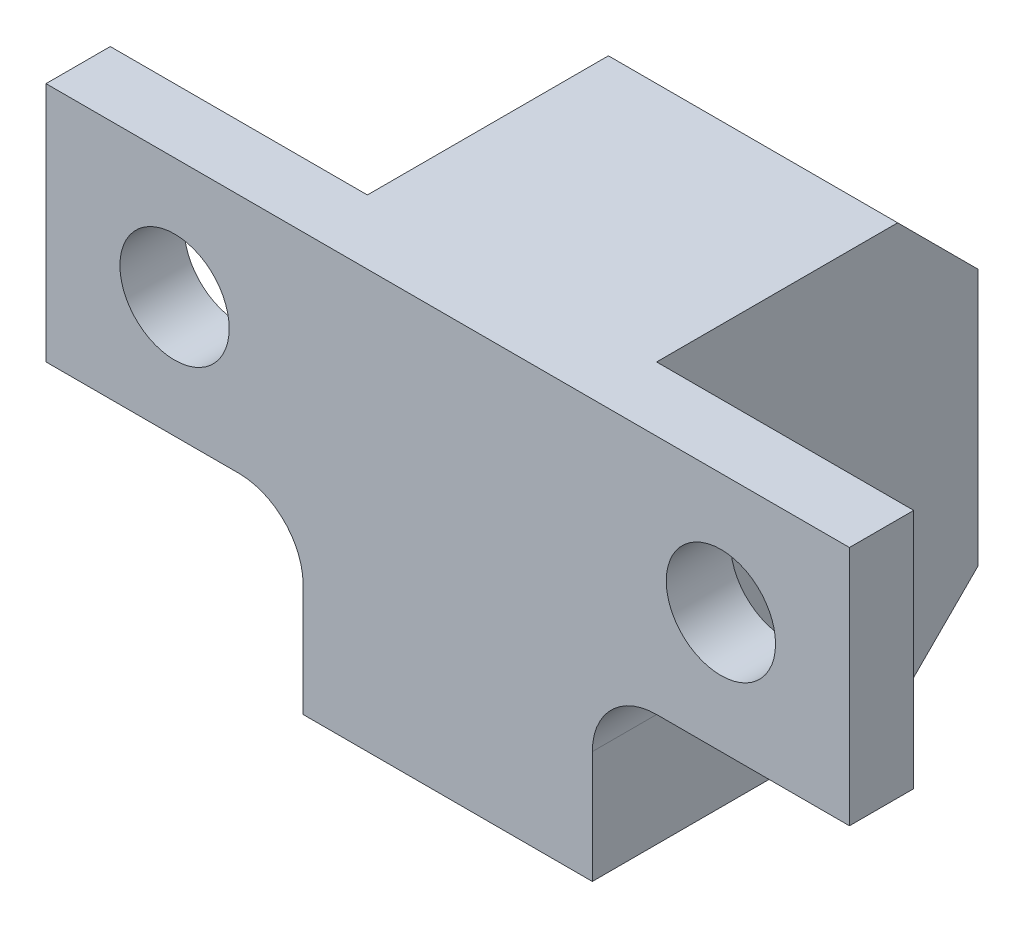
ISO-10303-21;
HEADER;
FILE_DESCRIPTION(('STEP AP214'),'2;1');
FILE_NAME('part.step','',(''),(''),'','','');
FILE_SCHEMA(('AUTOMOTIVE_DESIGN { 1 0 10303 214 1 1 1 1 }'));
ENDSEC;
DATA;
#1=APPLICATION_CONTEXT('core data for automotive mechanical design processes');
#2=APPLICATION_PROTOCOL_DEFINITION('international standard','automotive_design',2000,#1);
#3=PRODUCT_CONTEXT('',#1,'mechanical');
#4=PRODUCT('Part','Part','',(#3));
#5=PRODUCT_RELATED_PRODUCT_CATEGORY('part','',(#4));
#6=PRODUCT_DEFINITION_FORMATION('','',#4);
#7=PRODUCT_DEFINITION_CONTEXT('part definition',#1,'design');
#8=PRODUCT_DEFINITION('design','',#6,#7);
#9=PRODUCT_DEFINITION_SHAPE('','',#8);
#10=(LENGTH_UNIT() NAMED_UNIT(*) SI_UNIT(.MILLI.,.METRE.));
#11=(NAMED_UNIT(*) PLANE_ANGLE_UNIT() SI_UNIT($,.RADIAN.));
#12=(NAMED_UNIT(*) SI_UNIT($,.STERADIAN.) SOLID_ANGLE_UNIT());
#13=UNCERTAINTY_MEASURE_WITH_UNIT(LENGTH_MEASURE(1.E-05),#10,'distance_accuracy_value','');
#14=(GEOMETRIC_REPRESENTATION_CONTEXT(3) GLOBAL_UNCERTAINTY_ASSIGNED_CONTEXT((#13)) GLOBAL_UNIT_ASSIGNED_CONTEXT((#10,
#11,#12)) REPRESENTATION_CONTEXT('',''));
#15=CARTESIAN_POINT('',(0.,0.,0.));
#16=DIRECTION('',(0.,0.,1.));
#17=DIRECTION('',(1.,0.,0.));
#18=AXIS2_PLACEMENT_3D('',#15,#16,#17);
#19=CARTESIAN_POINT('',(0.,15.,0.));
#20=DIRECTION('',(0.,0.,-1.));
#21=DIRECTION('',(-1.,0.,0.));
#22=AXIS2_PLACEMENT_3D('',#19,#20,#21);
#23=PLANE('',#22);
#24=CARTESIAN_POINT('',(4.,11.25,0.));
#25=DIRECTION('',(0.,0.,-1.));
#26=DIRECTION('',(-1.,0.,0.));
#27=AXIS2_PLACEMENT_3D('',#24,#25,#26);
#28=CIRCLE('',#27,1.7);
#29=CARTESIAN_POINT('',(2.3,11.25,0.));
#30=VERTEX_POINT('',#29);
#31=EDGE_CURVE('E187',#30,#30,#28,.T.);
#32=ORIENTED_EDGE('',*,*,#31,.F.);
#33=EDGE_LOOP('',(#32));
#34=FACE_BOUND('',#33,.T.);
#35=DIRECTION('',(1.,0.,0.));
#36=VECTOR('',#35,1.);
#37=CARTESIAN_POINT('',(0.,7.5,0.));
#38=LINE('',#37,#36);
#39=CARTESIAN_POINT('',(0.,7.5,0.));
#40=VERTEX_POINT('',#39);
#41=CARTESIAN_POINT('',(6.,7.5,0.));
#42=VERTEX_POINT('',#41);
#43=EDGE_CURVE('E241',#40,#42,#38,.T.);
#44=ORIENTED_EDGE('',*,*,#43,.F.);
#45=DIRECTION('',(0.,-1.,0.));
#46=VECTOR('',#45,1.);
#47=CARTESIAN_POINT('',(0.,15.,0.));
#48=LINE('',#47,#46);
#49=CARTESIAN_POINT('',(0.,15.,0.));
#50=VERTEX_POINT('',#49);
#51=EDGE_CURVE('E147',#50,#40,#48,.T.);
#52=ORIENTED_EDGE('',*,*,#51,.F.);
#53=DIRECTION('',(1.,0.,0.));
#54=VECTOR('',#53,1.);
#55=CARTESIAN_POINT('',(0.,15.,0.));
#56=LINE('',#55,#54);
#57=CARTESIAN_POINT('',(8.,15.,0.));
#58=VERTEX_POINT('',#57);
#59=EDGE_CURVE('E240',#50,#58,#56,.T.);
#60=ORIENTED_EDGE('',*,*,#59,.T.);
#61=DIRECTION('',(0.,-1.,0.));
#62=VECTOR('',#61,1.);
#63=CARTESIAN_POINT('',(8.,15.,0.));
#64=LINE('',#63,#62);
#65=CARTESIAN_POINT('',(8.,5.5,0.));
#66=VERTEX_POINT('',#65);
#67=EDGE_CURVE('E175',#58,#66,#64,.T.);
#68=ORIENTED_EDGE('',*,*,#67,.T.);
#69=CARTESIAN_POINT('',(6.,5.5,0.));
#70=DIRECTION('',(0.,0.,-1.));
#71=DIRECTION('',(-1.,0.,0.));
#72=AXIS2_PLACEMENT_3D('',#69,#70,#71);
#73=CIRCLE('',#72,2.);
#74=EDGE_CURVE('E42',#66,#42,#73,.F.);
#75=ORIENTED_EDGE('',*,*,#74,.T.);
#76=EDGE_LOOP('',(#44,#52,#60,#68,#75));
#77=FACE_BOUND('',#76,.T.);
#78=ADVANCED_FACE('F34',(#34,#77),#23,.T.);
#79=CARTESIAN_POINT('',(0.,15.,2.));
#80=DIRECTION('',(-1.,0.,0.));
#81=DIRECTION('',(0.,0.,1.));
#82=AXIS2_PLACEMENT_3D('',#79,#80,#81);
#83=PLANE('',#82);
#84=DIRECTION('',(0.,0.,-1.));
#85=VECTOR('',#84,1.);
#86=CARTESIAN_POINT('',(0.,7.5,2.));
#87=LINE('',#86,#85);
#88=CARTESIAN_POINT('',(0.,7.5,2.));
#89=VERTEX_POINT('',#88);
#90=EDGE_CURVE('E134',#89,#40,#87,.T.);
#91=ORIENTED_EDGE('',*,*,#90,.F.);
#92=DIRECTION('',(0.,-1.,0.));
#93=VECTOR('',#92,1.);
#94=CARTESIAN_POINT('',(0.,15.,2.));
#95=LINE('',#94,#93);
#96=CARTESIAN_POINT('',(0.,15.,2.));
#97=VERTEX_POINT('',#96);
#98=EDGE_CURVE('E145',#97,#89,#95,.T.);
#99=ORIENTED_EDGE('',*,*,#98,.F.);
#100=DIRECTION('',(0.,0.,-1.));
#101=VECTOR('',#100,1.);
#102=CARTESIAN_POINT('',(0.,15.,2.));
#103=LINE('',#102,#101);
#104=EDGE_CURVE('E177',#97,#50,#103,.T.);
#105=ORIENTED_EDGE('',*,*,#104,.T.);
#106=ORIENTED_EDGE('',*,*,#51,.T.);
#107=EDGE_LOOP('',(#91,#99,#105,#106));
#108=FACE_BOUND('',#107,.T.);
#109=ADVANCED_FACE('F143',(#108),#83,.T.);
#110=CARTESIAN_POINT('',(25.,15.,2.));
#111=DIRECTION('',(0.,0.,1.));
#112=DIRECTION('',(1.,0.,0.));
#113=AXIS2_PLACEMENT_3D('',#110,#111,#112);
#114=PLANE('',#113);
#115=CARTESIAN_POINT('',(4.,11.25,2.));
#116=DIRECTION('',(0.,0.,1.));
#117=DIRECTION('',(1.,0.,0.));
#118=AXIS2_PLACEMENT_3D('',#115,#116,#117);
#119=CIRCLE('',#118,1.7);
#120=CARTESIAN_POINT('',(5.7,11.25,2.));
#121=VERTEX_POINT('',#120);
#122=EDGE_CURVE('E184',#121,#121,#119,.T.);
#123=ORIENTED_EDGE('',*,*,#122,.F.);
#124=EDGE_LOOP('',(#123));
#125=FACE_BOUND('',#124,.T.);
#126=CARTESIAN_POINT('',(21.,11.25,2.));
#127=DIRECTION('',(0.,0.,1.));
#128=DIRECTION('',(1.,0.,0.));
#129=AXIS2_PLACEMENT_3D('',#126,#127,#128);
#130=CIRCLE('',#129,1.7);
#131=CARTESIAN_POINT('',(22.7,11.25,2.));
#132=VERTEX_POINT('',#131);
#133=EDGE_CURVE('E139',#132,#132,#130,.T.);
#134=ORIENTED_EDGE('',*,*,#133,.F.);
#135=EDGE_LOOP('',(#134));
#136=FACE_BOUND('',#135,.T.);
#137=DIRECTION('',(0.,1.,0.));
#138=VECTOR('',#137,1.);
#139=CARTESIAN_POINT('',(17.,7.5,2.));
#140=LINE('',#139,#138);
#141=CARTESIAN_POINT('',(17.,2.,2.));
#142=VERTEX_POINT('',#141);
#143=CARTESIAN_POINT('',(17.,5.5,2.));
#144=VERTEX_POINT('',#143);
#145=EDGE_CURVE('E223',#142,#144,#140,.T.);
#146=ORIENTED_EDGE('',*,*,#145,.T.);
#147=CARTESIAN_POINT('',(19.,5.5,2.));
#148=DIRECTION('',(0.,0.,1.));
#149=DIRECTION('',(1.,0.,0.));
#150=AXIS2_PLACEMENT_3D('',#147,#148,#149);
#151=CIRCLE('',#150,2.);
#152=CARTESIAN_POINT('',(19.,7.5,2.));
#153=VERTEX_POINT('',#152);
#154=EDGE_CURVE('E217',#144,#153,#151,.F.);
#155=ORIENTED_EDGE('',*,*,#154,.T.);
#156=DIRECTION('',(1.,0.,0.));
#157=VECTOR('',#156,1.);
#158=CARTESIAN_POINT('',(25.,7.5,2.));
#159=LINE('',#158,#157);
#160=CARTESIAN_POINT('',(25.,7.5,2.));
#161=VERTEX_POINT('',#160);
#162=EDGE_CURVE('E149',#153,#161,#159,.T.);
#163=ORIENTED_EDGE('',*,*,#162,.T.);
#164=DIRECTION('',(0.,-1.,0.));
#165=VECTOR('',#164,1.);
#166=CARTESIAN_POINT('',(25.,15.,2.));
#167=LINE('',#166,#165);
#168=CARTESIAN_POINT('',(25.,15.,2.));
#169=VERTEX_POINT('',#168);
#170=EDGE_CURVE('E156',#169,#161,#167,.T.);
#171=ORIENTED_EDGE('',*,*,#170,.F.);
#172=DIRECTION('',(-1.,0.,0.));
#173=VECTOR('',#172,1.);
#174=CARTESIAN_POINT('',(25.,15.,2.));
#175=LINE('',#174,#173);
#176=EDGE_CURVE('E154',#169,#97,#175,.T.);
#177=ORIENTED_EDGE('',*,*,#176,.T.);
#178=ORIENTED_EDGE('',*,*,#98,.T.);
#179=DIRECTION('',(1.,0.,0.));
#180=VECTOR('',#179,1.);
#181=CARTESIAN_POINT('',(8.,7.5,2.));
#182=LINE('',#181,#180);
#183=CARTESIAN_POINT('',(6.,7.5,2.));
#184=VERTEX_POINT('',#183);
#185=EDGE_CURVE('E131',#89,#184,#182,.T.);
#186=ORIENTED_EDGE('',*,*,#185,.T.);
#187=CARTESIAN_POINT('',(6.,5.5,2.));
#188=DIRECTION('',(0.,0.,1.));
#189=DIRECTION('',(1.,0.,0.));
#190=AXIS2_PLACEMENT_3D('',#187,#188,#189);
#191=CIRCLE('',#190,2.);
#192=CARTESIAN_POINT('',(8.,5.5,2.));
#193=VERTEX_POINT('',#192);
#194=EDGE_CURVE('E11',#184,#193,#191,.F.);
#195=ORIENTED_EDGE('',*,*,#194,.T.);
#196=DIRECTION('',(0.,-1.,0.));
#197=VECTOR('',#196,1.);
#198=CARTESIAN_POINT('',(8.,7.5,2.));
#199=LINE('',#198,#197);
#200=CARTESIAN_POINT('',(8.,2.,2.));
#201=VERTEX_POINT('',#200);
#202=EDGE_CURVE('E138',#193,#201,#199,.T.);
#203=ORIENTED_EDGE('',*,*,#202,.T.);
#204=DIRECTION('',(1.,0.,0.));
#205=VECTOR('',#204,1.);
#206=CARTESIAN_POINT('',(17.,2.,2.));
#207=LINE('',#206,#205);
#208=EDGE_CURVE('E270',#201,#142,#207,.T.);
#209=ORIENTED_EDGE('',*,*,#208,.T.);
#210=EDGE_LOOP('',(#146,#155,#163,#171,#177,#178,#186,#195,#203,#209));
#211=FACE_BOUND('',#210,.T.);
#212=ADVANCED_FACE('F152',(#125,#136,#211),#114,.T.);
#213=CARTESIAN_POINT('',(25.,15.,0.));
#214=DIRECTION('',(1.,0.,0.));
#215=DIRECTION('',(0.,0.,-1.));
#216=AXIS2_PLACEMENT_3D('',#213,#214,#215);
#217=PLANE('',#216);
#218=DIRECTION('',(0.,0.,-1.));
#219=VECTOR('',#218,1.);
#220=CARTESIAN_POINT('',(25.,7.5,2.));
#221=LINE('',#220,#219);
#222=CARTESIAN_POINT('',(25.,7.5,0.));
#223=VERTEX_POINT('',#222);
#224=EDGE_CURVE('E231',#161,#223,#221,.T.);
#225=ORIENTED_EDGE('',*,*,#224,.T.);
#226=DIRECTION('',(0.,-1.,0.));
#227=VECTOR('',#226,1.);
#228=CARTESIAN_POINT('',(25.,15.,0.));
#229=LINE('',#228,#227);
#230=CARTESIAN_POINT('',(25.,15.,0.));
#231=VERTEX_POINT('',#230);
#232=EDGE_CURVE('E161',#231,#223,#229,.T.);
#233=ORIENTED_EDGE('',*,*,#232,.F.);
#234=DIRECTION('',(0.,0.,1.));
#235=VECTOR('',#234,1.);
#236=CARTESIAN_POINT('',(25.,15.,0.));
#237=LINE('',#236,#235);
#238=EDGE_CURVE('E254',#231,#169,#237,.T.);
#239=ORIENTED_EDGE('',*,*,#238,.T.);
#240=ORIENTED_EDGE('',*,*,#170,.T.);
#241=EDGE_LOOP('',(#225,#233,#239,#240));
#242=FACE_BOUND('',#241,.T.);
#243=ADVANCED_FACE('F297',(#242),#217,.T.);
#244=CARTESIAN_POINT('',(17.,15.,0.));
#245=DIRECTION('',(0.,0.,-1.));
#246=DIRECTION('',(-1.,0.,0.));
#247=AXIS2_PLACEMENT_3D('',#244,#245,#246);
#248=PLANE('',#247);
#249=CARTESIAN_POINT('',(21.,11.25,0.));
#250=DIRECTION('',(0.,0.,-1.));
#251=DIRECTION('',(-1.,0.,0.));
#252=AXIS2_PLACEMENT_3D('',#249,#250,#251);
#253=CIRCLE('',#252,1.7);
#254=CARTESIAN_POINT('',(19.3,11.25,0.));
#255=VERTEX_POINT('',#254);
#256=EDGE_CURVE('E183',#255,#255,#253,.T.);
#257=ORIENTED_EDGE('',*,*,#256,.F.);
#258=EDGE_LOOP('',(#257));
#259=FACE_BOUND('',#258,.T.);
#260=DIRECTION('',(1.,0.,0.));
#261=VECTOR('',#260,1.);
#262=CARTESIAN_POINT('',(17.,7.5,0.));
#263=LINE('',#262,#261);
#264=CARTESIAN_POINT('',(19.,7.5,0.));
#265=VERTEX_POINT('',#264);
#266=EDGE_CURVE('E239',#265,#223,#263,.T.);
#267=ORIENTED_EDGE('',*,*,#266,.F.);
#268=CARTESIAN_POINT('',(19.,5.5,0.));
#269=DIRECTION('',(0.,0.,-1.));
#270=DIRECTION('',(-1.,0.,0.));
#271=AXIS2_PLACEMENT_3D('',#268,#269,#270);
#272=CIRCLE('',#271,2.);
#273=CARTESIAN_POINT('',(17.,5.5,0.));
#274=VERTEX_POINT('',#273);
#275=EDGE_CURVE('E214',#265,#274,#272,.F.);
#276=ORIENTED_EDGE('',*,*,#275,.T.);
#277=DIRECTION('',(0.,-1.,0.));
#278=VECTOR('',#277,1.);
#279=CARTESIAN_POINT('',(17.,15.,0.));
#280=LINE('',#279,#278);
#281=CARTESIAN_POINT('',(17.,15.,0.));
#282=VERTEX_POINT('',#281);
#283=EDGE_CURVE('E167',#282,#274,#280,.T.);
#284=ORIENTED_EDGE('',*,*,#283,.F.);
#285=DIRECTION('',(1.,0.,0.));
#286=VECTOR('',#285,1.);
#287=CARTESIAN_POINT('',(17.,15.,0.));
#288=LINE('',#287,#286);
#289=EDGE_CURVE('E252',#282,#231,#288,.T.);
#290=ORIENTED_EDGE('',*,*,#289,.T.);
#291=ORIENTED_EDGE('',*,*,#232,.T.);
#292=EDGE_LOOP('',(#267,#276,#284,#290,#291));
#293=FACE_BOUND('',#292,.T.);
#294=ADVANCED_FACE('F236',(#259,#293),#248,.T.);
#295=CARTESIAN_POINT('',(17.,15.,-10.));
#296=DIRECTION('',(1.,0.,0.));
#297=DIRECTION('',(0.,0.,-1.));
#298=AXIS2_PLACEMENT_3D('',#295,#296,#297);
#299=PLANE('',#298);
#300=CARTESIAN_POINT('',(17.,5.25,-6.));
#301=DIRECTION('',(1.,0.,0.));
#302=DIRECTION('',(0.,0.,-1.));
#303=AXIS2_PLACEMENT_3D('',#300,#301,#302);
#304=CIRCLE('',#303,1.25);
#305=CARTESIAN_POINT('',(17.,5.25,-7.25));
#306=VERTEX_POINT('',#305);
#307=EDGE_CURVE('E470',#306,#306,#304,.T.);
#308=ORIENTED_EDGE('',*,*,#307,.F.);
#309=EDGE_LOOP('',(#308));
#310=FACE_BOUND('',#309,.T.);
#311=ORIENTED_EDGE('',*,*,#283,.T.);
#312=DIRECTION('',(0.,0.,-1.));
#313=VECTOR('',#312,1.);
#314=CARTESIAN_POINT('',(17.,5.5,-10.));
#315=LINE('',#314,#313);
#316=EDGE_CURVE('E208',#274,#144,#315,.F.);
#317=ORIENTED_EDGE('',*,*,#316,.T.);
#318=ORIENTED_EDGE('',*,*,#145,.F.);
#319=DIRECTION('',(0.,0.,-1.));
#320=VECTOR('',#319,1.);
#321=CARTESIAN_POINT('',(17.,2.,2.));
#322=LINE('',#321,#320);
#323=CARTESIAN_POINT('',(17.,2.,-7.50000000000001));
#324=VERTEX_POINT('',#323);
#325=EDGE_CURVE('E148',#142,#324,#322,.T.);
#326=ORIENTED_EDGE('',*,*,#325,.T.);
#327=DIRECTION('',(0.,0.707106781186549,-0.707106781186546));
#328=VECTOR('',#327,1.);
#329=CARTESIAN_POINT('',(17.,9.75000000000002,-15.25));
#330=LINE('',#329,#328);
#331=CARTESIAN_POINT('',(17.,4.5,-10.));
#332=VERTEX_POINT('',#331);
#333=EDGE_CURVE('E192',#324,#332,#330,.T.);
#334=ORIENTED_EDGE('',*,*,#333,.T.);
#335=DIRECTION('',(0.,-1.,0.));
#336=VECTOR('',#335,1.);
#337=CARTESIAN_POINT('',(17.,15.,-10.));
#338=LINE('',#337,#336);
#339=CARTESIAN_POINT('',(17.,12.5,-10.));
#340=VERTEX_POINT('',#339);
#341=EDGE_CURVE('E169',#340,#332,#338,.T.);
#342=ORIENTED_EDGE('',*,*,#341,.F.);
#343=DIRECTION('',(0.,-0.707106781186546,-0.707106781186549));
#344=VECTOR('',#343,1.);
#345=CARTESIAN_POINT('',(17.,13.75,-8.75));
#346=LINE('',#345,#344);
#347=CARTESIAN_POINT('',(17.,15.,-7.49999999999999));
#348=VERTEX_POINT('',#347);
#349=EDGE_CURVE('E194',#340,#348,#346,.F.);
#350=ORIENTED_EDGE('',*,*,#349,.T.);
#351=DIRECTION('',(0.,0.,1.));
#352=VECTOR('',#351,1.);
#353=CARTESIAN_POINT('',(17.,15.,-10.));
#354=LINE('',#353,#352);
#355=EDGE_CURVE('E250',#348,#282,#354,.T.);
#356=ORIENTED_EDGE('',*,*,#355,.T.);
#357=EDGE_LOOP('',(#311,#317,#318,#326,#334,#342,#350,#356));
#358=FACE_BOUND('',#357,.T.);
#359=ADVANCED_FACE('F279',(#310,#358),#299,.T.);
#360=CARTESIAN_POINT('',(8.,15.,-10.));
#361=DIRECTION('',(0.,0.,-1.));
#362=DIRECTION('',(-1.,0.,0.));
#363=AXIS2_PLACEMENT_3D('',#360,#361,#362);
#364=PLANE('',#363);
#365=DIRECTION('',(0.,-1.,0.));
#366=VECTOR('',#365,1.);
#367=CARTESIAN_POINT('',(8.,15.,-10.));
#368=LINE('',#367,#366);
#369=CARTESIAN_POINT('',(8.,12.5,-10.));
#370=VERTEX_POINT('',#369);
#371=CARTESIAN_POINT('',(8.,4.5,-10.));
#372=VERTEX_POINT('',#371);
#373=EDGE_CURVE('E172',#370,#372,#368,.T.);
#374=ORIENTED_EDGE('',*,*,#373,.F.);
#375=DIRECTION('',(1.,0.,0.));
#376=VECTOR('',#375,1.);
#377=CARTESIAN_POINT('',(8.,12.5,-10.));
#378=LINE('',#377,#376);
#379=EDGE_CURVE('E189',#370,#340,#378,.T.);
#380=ORIENTED_EDGE('',*,*,#379,.T.);
#381=ORIENTED_EDGE('',*,*,#341,.T.);
#382=DIRECTION('',(-1.,0.,0.));
#383=VECTOR('',#382,1.);
#384=CARTESIAN_POINT('',(8.,4.5,-10.));
#385=LINE('',#384,#383);
#386=EDGE_CURVE('E180',#332,#372,#385,.T.);
#387=ORIENTED_EDGE('',*,*,#386,.T.);
#388=EDGE_LOOP('',(#374,#380,#381,#387));
#389=FACE_BOUND('',#388,.T.);
#390=ADVANCED_FACE('F290',(#389),#364,.T.);
#391=CARTESIAN_POINT('',(8.,15.,0.));
#392=DIRECTION('',(-1.,0.,0.));
#393=DIRECTION('',(0.,0.,1.));
#394=AXIS2_PLACEMENT_3D('',#391,#392,#393);
#395=PLANE('',#394);
#396=CARTESIAN_POINT('',(8.,5.25,-6.));
#397=DIRECTION('',(-1.,0.,0.));
#398=DIRECTION('',(0.,0.,1.));
#399=AXIS2_PLACEMENT_3D('',#396,#397,#398);
#400=CIRCLE('',#399,1.25);
#401=CARTESIAN_POINT('',(8.,5.25,-4.75));
#402=VERTEX_POINT('',#401);
#403=EDGE_CURVE('E473',#402,#402,#400,.T.);
#404=ORIENTED_EDGE('',*,*,#403,.F.);
#405=EDGE_LOOP('',(#404));
#406=FACE_BOUND('',#405,.T.);
#407=ORIENTED_EDGE('',*,*,#202,.F.);
#408=DIRECTION('',(0.,0.,-1.));
#409=VECTOR('',#408,1.);
#410=CARTESIAN_POINT('',(8.,5.5,0.));
#411=LINE('',#410,#409);
#412=EDGE_CURVE('E210',#193,#66,#411,.T.);
#413=ORIENTED_EDGE('',*,*,#412,.T.);
#414=ORIENTED_EDGE('',*,*,#67,.F.);
#415=DIRECTION('',(0.,0.,-1.));
#416=VECTOR('',#415,1.);
#417=CARTESIAN_POINT('',(8.,15.,0.));
#418=LINE('',#417,#416);
#419=CARTESIAN_POINT('',(8.,15.,-7.49999999999999));
#420=VERTEX_POINT('',#419);
#421=EDGE_CURVE('E244',#58,#420,#418,.T.);
#422=ORIENTED_EDGE('',*,*,#421,.T.);
#423=DIRECTION('',(0.,0.707106781186546,0.707106781186549));
#424=VECTOR('',#423,1.);
#425=CARTESIAN_POINT('',(8.,18.75,-3.74999999999998));
#426=LINE('',#425,#424);
#427=EDGE_CURVE('E200',#420,#370,#426,.F.);
#428=ORIENTED_EDGE('',*,*,#427,.T.);
#429=ORIENTED_EDGE('',*,*,#373,.T.);
#430=DIRECTION('',(0.,-0.707106781186549,0.707106781186546));
#431=VECTOR('',#430,1.);
#432=CARTESIAN_POINT('',(8.,4.75000000000002,-10.25));
#433=LINE('',#432,#431);
#434=CARTESIAN_POINT('',(8.,2.,-7.50000000000001));
#435=VERTEX_POINT('',#434);
#436=EDGE_CURVE('E198',#372,#435,#433,.T.);
#437=ORIENTED_EDGE('',*,*,#436,.T.);
#438=DIRECTION('',(0.,0.,-1.));
#439=VECTOR('',#438,1.);
#440=CARTESIAN_POINT('',(8.,2.,0.));
#441=LINE('',#440,#439);
#442=EDGE_CURVE('E158',#201,#435,#441,.T.);
#443=ORIENTED_EDGE('',*,*,#442,.F.);
#444=EDGE_LOOP('',(#407,#413,#414,#422,#428,#429,#437,#443));
#445=FACE_BOUND('',#444,.T.);
#446=ADVANCED_FACE('F268',(#406,#445),#395,.T.);
#447=CARTESIAN_POINT('',(0.,15.,0.));
#448=DIRECTION('',(0.,1.,0.));
#449=DIRECTION('',(0.,0.,1.));
#450=AXIS2_PLACEMENT_3D('',#447,#448,#449);
#451=PLANE('',#450);
#452=ORIENTED_EDGE('',*,*,#355,.F.);
#453=DIRECTION('',(-1.,0.,0.));
#454=VECTOR('',#453,1.);
#455=CARTESIAN_POINT('',(0.,15.,-7.49999999999999));
#456=LINE('',#455,#454);
#457=EDGE_CURVE('E196',#348,#420,#456,.T.);
#458=ORIENTED_EDGE('',*,*,#457,.T.);
#459=ORIENTED_EDGE('',*,*,#421,.F.);
#460=ORIENTED_EDGE('',*,*,#59,.F.);
#461=ORIENTED_EDGE('',*,*,#104,.F.);
#462=ORIENTED_EDGE('',*,*,#176,.F.);
#463=ORIENTED_EDGE('',*,*,#238,.F.);
#464=ORIENTED_EDGE('',*,*,#289,.F.);
#465=EDGE_LOOP('',(#452,#458,#459,#460,#461,#462,#463,#464));
#466=FACE_BOUND('',#465,.T.);
#467=ADVANCED_FACE('F260',(#466),#451,.T.);
#468=CARTESIAN_POINT('',(25.,7.5,2.));
#469=DIRECTION('',(0.,1.,0.));
#470=DIRECTION('',(0.,0.,1.));
#471=AXIS2_PLACEMENT_3D('',#468,#469,#470);
#472=PLANE('',#471);
#473=ORIENTED_EDGE('',*,*,#162,.F.);
#474=DIRECTION('',(0.,0.,-1.));
#475=VECTOR('',#474,1.);
#476=CARTESIAN_POINT('',(19.,7.5,2.));
#477=LINE('',#476,#475);
#478=EDGE_CURVE('E205',#153,#265,#477,.T.);
#479=ORIENTED_EDGE('',*,*,#478,.T.);
#480=ORIENTED_EDGE('',*,*,#266,.T.);
#481=ORIENTED_EDGE('',*,*,#224,.F.);
#482=EDGE_LOOP('',(#473,#479,#480,#481));
#483=FACE_BOUND('',#482,.T.);
#484=ADVANCED_FACE('F228',(#483),#472,.F.);
#485=CARTESIAN_POINT('',(17.,2.,2.));
#486=DIRECTION('',(0.,1.,0.));
#487=DIRECTION('',(0.,0.,1.));
#488=AXIS2_PLACEMENT_3D('',#485,#486,#487);
#489=PLANE('',#488);
#490=ORIENTED_EDGE('',*,*,#442,.T.);
#491=DIRECTION('',(1.,0.,0.));
#492=VECTOR('',#491,1.);
#493=CARTESIAN_POINT('',(17.,2.,-7.50000000000001));
#494=LINE('',#493,#492);
#495=EDGE_CURVE('E202',#435,#324,#494,.T.);
#496=ORIENTED_EDGE('',*,*,#495,.T.);
#497=ORIENTED_EDGE('',*,*,#325,.F.);
#498=ORIENTED_EDGE('',*,*,#208,.F.);
#499=EDGE_LOOP('',(#490,#496,#497,#498));
#500=FACE_BOUND('',#499,.T.);
#501=ADVANCED_FACE('F282',(#500),#489,.F.);
#502=CARTESIAN_POINT('',(8.,7.5,2.));
#503=DIRECTION('',(0.,1.,0.));
#504=DIRECTION('',(0.,0.,1.));
#505=AXIS2_PLACEMENT_3D('',#502,#503,#504);
#506=PLANE('',#505);
#507=ORIENTED_EDGE('',*,*,#43,.T.);
#508=DIRECTION('',(0.,0.,-1.));
#509=VECTOR('',#508,1.);
#510=CARTESIAN_POINT('',(6.,7.5,2.));
#511=LINE('',#510,#509);
#512=EDGE_CURVE('E49',#42,#184,#511,.F.);
#513=ORIENTED_EDGE('',*,*,#512,.T.);
#514=ORIENTED_EDGE('',*,*,#185,.F.);
#515=ORIENTED_EDGE('',*,*,#90,.T.);
#516=EDGE_LOOP('',(#507,#513,#514,#515));
#517=FACE_BOUND('',#516,.T.);
#518=ADVANCED_FACE('F133',(#517),#506,.F.);
#519=CARTESIAN_POINT('',(21.,11.25,0.));
#520=DIRECTION('',(0.,0.,-1.));
#521=DIRECTION('',(-1.,0.,0.));
#522=AXIS2_PLACEMENT_3D('',#519,#520,#521);
#523=CYLINDRICAL_SURFACE('',#522,1.7);
#524=ORIENTED_EDGE('',*,*,#133,.T.);
#525=EDGE_LOOP('',(#524));
#526=FACE_BOUND('',#525,.T.);
#527=ORIENTED_EDGE('',*,*,#256,.T.);
#528=EDGE_LOOP('',(#527));
#529=FACE_BOUND('',#528,.T.);
#530=ADVANCED_FACE('F343',(#526,#529),#523,.F.);
#531=CARTESIAN_POINT('',(4.,11.25,0.));
#532=DIRECTION('',(0.,0.,-1.));
#533=DIRECTION('',(-1.,0.,0.));
#534=AXIS2_PLACEMENT_3D('',#531,#532,#533);
#535=CYLINDRICAL_SURFACE('',#534,1.7);
#536=ORIENTED_EDGE('',*,*,#122,.T.);
#537=EDGE_LOOP('',(#536));
#538=FACE_BOUND('',#537,.T.);
#539=ORIENTED_EDGE('',*,*,#31,.T.);
#540=EDGE_LOOP('',(#539));
#541=FACE_BOUND('',#540,.T.);
#542=ADVANCED_FACE('F434',(#538,#541),#535,.F.);
#543=CARTESIAN_POINT('',(8.,5.25,-6.));
#544=DIRECTION('',(-1.,0.,0.));
#545=DIRECTION('',(0.,0.,1.));
#546=AXIS2_PLACEMENT_3D('',#543,#544,#545);
#547=CYLINDRICAL_SURFACE('',#546,1.25);
#548=ORIENTED_EDGE('',*,*,#307,.T.);
#549=EDGE_LOOP('',(#548));
#550=FACE_BOUND('',#549,.T.);
#551=ORIENTED_EDGE('',*,*,#403,.T.);
#552=EDGE_LOOP('',(#551));
#553=FACE_BOUND('',#552,.T.);
#554=ADVANCED_FACE('F321',(#550,#553),#547,.F.);
#555=CARTESIAN_POINT('',(8.,12.5,-10.));
#556=DIRECTION('',(0.,-0.707106781186549,0.707106781186546));
#557=DIRECTION('',(1.,0.,0.));
#558=AXIS2_PLACEMENT_3D('',#555,#556,#557);
#559=PLANE('',#558);
#560=ORIENTED_EDGE('',*,*,#427,.F.);
#561=ORIENTED_EDGE('',*,*,#457,.F.);
#562=ORIENTED_EDGE('',*,*,#349,.F.);
#563=ORIENTED_EDGE('',*,*,#379,.F.);
#564=EDGE_LOOP('',(#560,#561,#562,#563));
#565=FACE_BOUND('',#564,.T.);
#566=ADVANCED_FACE('F295',(#565),#559,.F.);
#567=CARTESIAN_POINT('',(17.,2.,-7.50000000000001));
#568=DIRECTION('',(0.,-0.707106781186546,-0.707106781186549));
#569=DIRECTION('',(-1.,0.,0.));
#570=AXIS2_PLACEMENT_3D('',#567,#568,#569);
#571=PLANE('',#570);
#572=ORIENTED_EDGE('',*,*,#436,.F.);
#573=ORIENTED_EDGE('',*,*,#386,.F.);
#574=ORIENTED_EDGE('',*,*,#333,.F.);
#575=ORIENTED_EDGE('',*,*,#495,.F.);
#576=EDGE_LOOP('',(#572,#573,#574,#575));
#577=FACE_BOUND('',#576,.T.);
#578=ADVANCED_FACE('F286',(#577),#571,.T.);
#579=CARTESIAN_POINT('',(19.,5.5,2.));
#580=DIRECTION('',(0.,0.,-1.));
#581=DIRECTION('',(-1.,0.,0.));
#582=AXIS2_PLACEMENT_3D('',#579,#580,#581);
#583=CYLINDRICAL_SURFACE('',#582,2.);
#584=ORIENTED_EDGE('',*,*,#154,.F.);
#585=ORIENTED_EDGE('',*,*,#316,.F.);
#586=ORIENTED_EDGE('',*,*,#275,.F.);
#587=ORIENTED_EDGE('',*,*,#478,.F.);
#588=EDGE_LOOP('',(#584,#585,#586,#587));
#589=FACE_BOUND('',#588,.T.);
#590=ADVANCED_FACE('F233',(#589),#583,.F.);
#591=CARTESIAN_POINT('',(6.,5.5,0.));
#592=DIRECTION('',(0.,0.,-1.));
#593=DIRECTION('',(-1.,0.,0.));
#594=AXIS2_PLACEMENT_3D('',#591,#592,#593);
#595=CYLINDRICAL_SURFACE('',#594,2.);
#596=ORIENTED_EDGE('',*,*,#194,.F.);
#597=ORIENTED_EDGE('',*,*,#512,.F.);
#598=ORIENTED_EDGE('',*,*,#74,.F.);
#599=ORIENTED_EDGE('',*,*,#412,.F.);
#600=EDGE_LOOP('',(#596,#597,#598,#599));
#601=FACE_BOUND('',#600,.T.);
#602=ADVANCED_FACE('F36',(#601),#595,.F.);
#603=CLOSED_SHELL('',(#78,#109,#212,#243,#294,#359,#390,#446,#467,#484,#501,#518,#530,#542,#554,
#566,#578,#590,#602));
#604=MANIFOLD_SOLID_BREP('B2',#603);
#605=ADVANCED_BREP_SHAPE_REPRESENTATION('',(#18,#604),#14);
#606=SHAPE_DEFINITION_REPRESENTATION(#9,#605);
ENDSEC;
END-ISO-10303-21;
